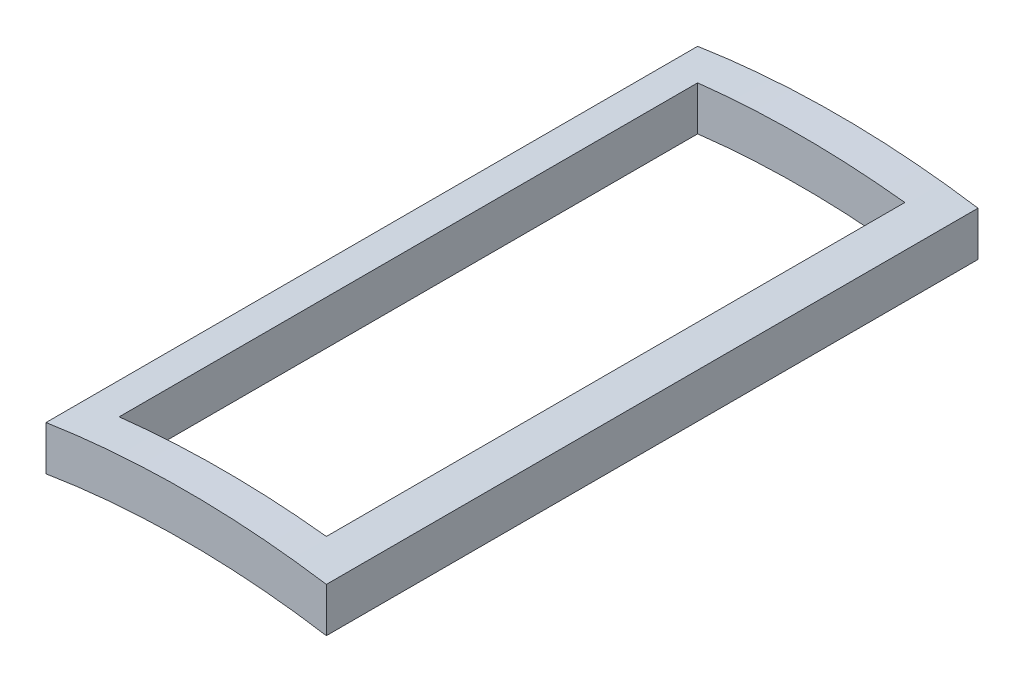
ISO-10303-21;
HEADER;
FILE_DESCRIPTION(('STEP AP214'),'2;1');
FILE_NAME('part.step','',(''),(''),'','','');
FILE_SCHEMA(('AUTOMOTIVE_DESIGN { 1 0 10303 214 1 1 1 1 }'));
ENDSEC;
DATA;
#1=APPLICATION_CONTEXT('core data for automotive mechanical design processes');
#2=APPLICATION_PROTOCOL_DEFINITION('international standard','automotive_design',2000,#1);
#3=PRODUCT_CONTEXT('',#1,'mechanical');
#4=PRODUCT('Part','Part','',(#3));
#5=PRODUCT_RELATED_PRODUCT_CATEGORY('part','',(#4));
#6=PRODUCT_DEFINITION_FORMATION('','',#4);
#7=PRODUCT_DEFINITION_CONTEXT('part definition',#1,'design');
#8=PRODUCT_DEFINITION('design','',#6,#7);
#9=PRODUCT_DEFINITION_SHAPE('','',#8);
#10=(LENGTH_UNIT() NAMED_UNIT(*) SI_UNIT(.MILLI.,.METRE.));
#11=(NAMED_UNIT(*) PLANE_ANGLE_UNIT() SI_UNIT($,.RADIAN.));
#12=(NAMED_UNIT(*) SI_UNIT($,.STERADIAN.) SOLID_ANGLE_UNIT());
#13=UNCERTAINTY_MEASURE_WITH_UNIT(LENGTH_MEASURE(1.E-05),#10,'distance_accuracy_value','');
#14=(GEOMETRIC_REPRESENTATION_CONTEXT(3) GLOBAL_UNCERTAINTY_ASSIGNED_CONTEXT((#13)) GLOBAL_UNIT_ASSIGNED_CONTEXT((#10,
#11,#12)) REPRESENTATION_CONTEXT('',''));
#15=CARTESIAN_POINT('',(0.,0.,0.));
#16=DIRECTION('',(0.,0.,1.));
#17=DIRECTION('',(1.,0.,0.));
#18=AXIS2_PLACEMENT_3D('',#15,#16,#17);
#19=CARTESIAN_POINT('',(-110.435261655171,-75.8999546142996,6.56206354763537));
#20=DIRECTION('',(0.,0.,1.));
#21=DIRECTION('',(0.,-1.,0.));
#22=AXIS2_PLACEMENT_3D('',#19,#20,#21);
#23=CYLINDRICAL_SURFACE('',#22,2.50000000000002);
#24=DIRECTION('',(0.,0.,1.));
#25=VECTOR('',#24,1.);
#26=CARTESIAN_POINT('',(-110.152003047214,-73.4160535371594,9.26746205984028));
#27=LINE('',#26,#25);
#28=CARTESIAN_POINT('',(-110.152003047214,-73.4160535371594,9.26746205984028));
#29=VERTEX_POINT('',#28);
#30=CARTESIAN_POINT('',(-110.152003047214,-73.4160535371594,7.6859348320808));
#31=VERTEX_POINT('',#30);
#32=EDGE_CURVE('E83',#29,#31,#27,.F.);
#33=ORIENTED_EDGE('',*,*,#32,.F.);
#34=CARTESIAN_POINT('',(-110.435261655171,-75.8999546142996,9.26746205984028));
#35=DIRECTION('',(0.,0.,1.));
#36=DIRECTION('',(0.,-1.,0.));
#37=AXIS2_PLACEMENT_3D('',#34,#35,#36);
#38=CIRCLE('',#37,2.50000000000002);
#39=CARTESIAN_POINT('',(-110.718520263128,-73.4160535371594,9.26746205984028));
#40=VERTEX_POINT('',#39);
#41=EDGE_CURVE('E93',#40,#29,#38,.F.);
#42=ORIENTED_EDGE('',*,*,#41,.F.);
#43=DIRECTION('',(0.,0.,-1.));
#44=VECTOR('',#43,1.);
#45=CARTESIAN_POINT('',(-110.718520263128,-73.4160535371594,7.6859348320808));
#46=LINE('',#45,#44);
#47=CARTESIAN_POINT('',(-110.718520263128,-73.4160535371594,7.6859348320808));
#48=VERTEX_POINT('',#47);
#49=EDGE_CURVE('E85',#48,#40,#46,.F.);
#50=ORIENTED_EDGE('',*,*,#49,.F.);
#51=CARTESIAN_POINT('',(-110.435261655171,-75.8999546142996,7.6859348320808));
#52=DIRECTION('',(0.,0.,1.));
#53=DIRECTION('',(0.,-1.,0.));
#54=AXIS2_PLACEMENT_3D('',#51,#52,#53);
#55=CIRCLE('',#54,2.50000000000002);
#56=EDGE_CURVE('E20',#48,#31,#55,.F.);
#57=ORIENTED_EDGE('',*,*,#56,.T.);
#58=EDGE_LOOP('',(#33,#42,#50,#57));
#59=FACE_BOUND('',#58,.T.);
#60=CARTESIAN_POINT('',(-110.435261655171,-75.8999546142996,9.36746205984028));
#61=DIRECTION('',(0.,0.,1.));
#62=DIRECTION('',(0.,-1.,0.));
#63=AXIS2_PLACEMENT_3D('',#60,#61,#62);
#64=CIRCLE('',#63,2.50000000000002);
#65=CARTESIAN_POINT('',(-110.052003047214,-73.4295067117064,9.36746205984028));
#66=VERTEX_POINT('',#65);
#67=CARTESIAN_POINT('',(-110.818520263128,-73.4295067117065,9.36746205984028));
#68=VERTEX_POINT('',#67);
#69=EDGE_CURVE('E86',#66,#68,#64,.T.);
#70=ORIENTED_EDGE('',*,*,#69,.F.);
#71=DIRECTION('',(0.,0.,-1.));
#72=VECTOR('',#71,1.);
#73=CARTESIAN_POINT('',(-110.052003047214,-73.4295067117064,7.5859348320808));
#74=LINE('',#73,#72);
#75=CARTESIAN_POINT('',(-110.052003047214,-73.4295067117064,7.5859348320808));
#76=VERTEX_POINT('',#75);
#77=EDGE_CURVE('E124',#76,#66,#74,.F.);
#78=ORIENTED_EDGE('',*,*,#77,.F.);
#79=CARTESIAN_POINT('',(-110.435261655171,-75.8999546142996,7.5859348320808));
#80=DIRECTION('',(0.,0.,1.));
#81=DIRECTION('',(0.,-1.,0.));
#82=AXIS2_PLACEMENT_3D('',#79,#80,#81);
#83=CIRCLE('',#82,2.50000000000002);
#84=CARTESIAN_POINT('',(-110.818520263128,-73.4295067117065,7.5859348320808));
#85=VERTEX_POINT('',#84);
#86=EDGE_CURVE('E113',#85,#76,#83,.F.);
#87=ORIENTED_EDGE('',*,*,#86,.F.);
#88=DIRECTION('',(0.,0.,1.));
#89=VECTOR('',#88,1.);
#90=CARTESIAN_POINT('',(-110.818520263128,-73.4295067117065,9.36746205984028));
#91=LINE('',#90,#89);
#92=EDGE_CURVE('E121',#68,#85,#91,.F.);
#93=ORIENTED_EDGE('',*,*,#92,.F.);
#94=EDGE_LOOP('',(#70,#78,#87,#93));
#95=FACE_BOUND('',#94,.T.);
#96=ADVANCED_FACE('F17',(#59,#95),#23,.T.);
#97=CARTESIAN_POINT('',(-110.052003047214,-76.3010935552146,9.36746205984028));
#98=DIRECTION('',(0.,0.,1.));
#99=DIRECTION('',(0.,-1.,0.));
#100=AXIS2_PLACEMENT_3D('',#97,#98,#99);
#101=PLANE('',#100);
#102=ORIENTED_EDGE('',*,*,#69,.T.);
#103=DIRECTION('',(0.,1.,0.));
#104=VECTOR('',#103,1.);
#105=CARTESIAN_POINT('',(-110.818520263128,-76.3010935552146,9.36746205984028));
#106=LINE('',#105,#104);
#107=CARTESIAN_POINT('',(-110.818520263128,-73.5510159519615,9.36746205984028));
#108=VERTEX_POINT('',#107);
#109=EDGE_CURVE('E112',#108,#68,#106,.T.);
#110=ORIENTED_EDGE('',*,*,#109,.F.);
#111=CARTESIAN_POINT('',(-110.435261655171,-75.8999546142996,9.36746205984028));
#112=DIRECTION('',(0.,0.,1.));
#113=DIRECTION('',(0.,-1.,0.));
#114=AXIS2_PLACEMENT_3D('',#111,#112,#113);
#115=CIRCLE('',#114,2.38000000000001);
#116=CARTESIAN_POINT('',(-110.052003047214,-73.5510159519615,9.36746205984028));
#117=VERTEX_POINT('',#116);
#118=EDGE_CURVE('E99',#108,#117,#115,.F.);
#119=ORIENTED_EDGE('',*,*,#118,.T.);
#120=DIRECTION('',(0.,1.,0.));
#121=VECTOR('',#120,1.);
#122=CARTESIAN_POINT('',(-110.052003047214,-76.3010935552146,9.36746205984028));
#123=LINE('',#122,#121);
#124=EDGE_CURVE('E122',#66,#117,#123,.F.);
#125=ORIENTED_EDGE('',*,*,#124,.F.);
#126=EDGE_LOOP('',(#102,#110,#119,#125));
#127=FACE_BOUND('',#126,.T.);
#128=ADVANCED_FACE('F141',(#127),#101,.T.);
#129=CARTESIAN_POINT('',(-110.052003047214,-76.3010935552146,7.5859348320808));
#130=DIRECTION('',(1.,0.,0.));
#131=DIRECTION('',(0.,0.,-1.));
#132=AXIS2_PLACEMENT_3D('',#129,#130,#131);
#133=PLANE('',#132);
#134=ORIENTED_EDGE('',*,*,#77,.T.);
#135=ORIENTED_EDGE('',*,*,#124,.T.);
#136=DIRECTION('',(0.,0.,1.));
#137=VECTOR('',#136,1.);
#138=CARTESIAN_POINT('',(-110.052003047214,-73.5510159519615,6.56206354763537));
#139=LINE('',#138,#137);
#140=CARTESIAN_POINT('',(-110.052003047214,-73.5510159519615,7.5859348320808));
#141=VERTEX_POINT('',#140);
#142=EDGE_CURVE('E114',#117,#141,#139,.F.);
#143=ORIENTED_EDGE('',*,*,#142,.T.);
#144=DIRECTION('',(0.,1.,0.));
#145=VECTOR('',#144,1.);
#146=CARTESIAN_POINT('',(-110.052003047214,-76.3010935552146,7.5859348320808));
#147=LINE('',#146,#145);
#148=EDGE_CURVE('E110',#76,#141,#147,.F.);
#149=ORIENTED_EDGE('',*,*,#148,.F.);
#150=EDGE_LOOP('',(#134,#135,#143,#149));
#151=FACE_BOUND('',#150,.T.);
#152=ADVANCED_FACE('F157',(#151),#133,.T.);
#153=CARTESIAN_POINT('',(-110.818520263128,-76.3010935552146,7.5859348320808));
#154=DIRECTION('',(0.,0.,-1.));
#155=DIRECTION('',(0.,1.,0.));
#156=AXIS2_PLACEMENT_3D('',#153,#154,#155);
#157=PLANE('',#156);
#158=ORIENTED_EDGE('',*,*,#86,.T.);
#159=ORIENTED_EDGE('',*,*,#148,.T.);
#160=CARTESIAN_POINT('',(-110.435261655171,-75.8999546142996,7.5859348320808));
#161=DIRECTION('',(0.,0.,1.));
#162=DIRECTION('',(0.,-1.,0.));
#163=AXIS2_PLACEMENT_3D('',#160,#161,#162);
#164=CIRCLE('',#163,2.38000000000001);
#165=CARTESIAN_POINT('',(-110.818520263128,-73.5510159519615,7.5859348320808));
#166=VERTEX_POINT('',#165);
#167=EDGE_CURVE('E117',#141,#166,#164,.T.);
#168=ORIENTED_EDGE('',*,*,#167,.T.);
#169=DIRECTION('',(0.,1.,0.));
#170=VECTOR('',#169,1.);
#171=CARTESIAN_POINT('',(-110.818520263128,-76.3010935552146,7.5859348320808));
#172=LINE('',#171,#170);
#173=EDGE_CURVE('E94',#85,#166,#172,.F.);
#174=ORIENTED_EDGE('',*,*,#173,.F.);
#175=EDGE_LOOP('',(#158,#159,#168,#174));
#176=FACE_BOUND('',#175,.T.);
#177=ADVANCED_FACE('F151',(#176),#157,.T.);
#178=CARTESIAN_POINT('',(-110.818520263128,-76.3010935552146,9.36746205984028));
#179=DIRECTION('',(-1.,0.,0.));
#180=DIRECTION('',(0.,0.,1.));
#181=AXIS2_PLACEMENT_3D('',#178,#179,#180);
#182=PLANE('',#181);
#183=ORIENTED_EDGE('',*,*,#92,.T.);
#184=ORIENTED_EDGE('',*,*,#173,.T.);
#185=DIRECTION('',(0.,0.,1.));
#186=VECTOR('',#185,1.);
#187=CARTESIAN_POINT('',(-110.818520263128,-73.5510159519615,6.56206354763537));
#188=LINE('',#187,#186);
#189=EDGE_CURVE('E107',#166,#108,#188,.T.);
#190=ORIENTED_EDGE('',*,*,#189,.T.);
#191=ORIENTED_EDGE('',*,*,#109,.T.);
#192=EDGE_LOOP('',(#183,#184,#190,#191));
#193=FACE_BOUND('',#192,.T.);
#194=ADVANCED_FACE('F145',(#193),#182,.T.);
#195=CARTESIAN_POINT('',(-110.152003047214,-76.3010935552146,9.26746205984028));
#196=DIRECTION('',(-1.,0.,0.));
#197=DIRECTION('',(0.,0.,1.));
#198=AXIS2_PLACEMENT_3D('',#195,#196,#197);
#199=PLANE('',#198);
#200=ORIENTED_EDGE('',*,*,#32,.T.);
#201=DIRECTION('',(0.,-1.,0.));
#202=VECTOR('',#201,1.);
#203=CARTESIAN_POINT('',(-110.152003047214,-76.3010935552146,7.6859348320808));
#204=LINE('',#203,#202);
#205=CARTESIAN_POINT('',(-110.152003047214,-73.5368709168783,7.6859348320808));
#206=VERTEX_POINT('',#205);
#207=EDGE_CURVE('E91',#206,#31,#204,.F.);
#208=ORIENTED_EDGE('',*,*,#207,.F.);
#209=DIRECTION('',(0.,0.,1.));
#210=VECTOR('',#209,1.);
#211=CARTESIAN_POINT('',(-110.152003047214,-73.5368709168783,6.56206354763537));
#212=LINE('',#211,#210);
#213=CARTESIAN_POINT('',(-110.152003047214,-73.5368709168783,9.26746205984028));
#214=VERTEX_POINT('',#213);
#215=EDGE_CURVE('E106',#206,#214,#212,.T.);
#216=ORIENTED_EDGE('',*,*,#215,.T.);
#217=DIRECTION('',(0.,1.,0.));
#218=VECTOR('',#217,1.);
#219=CARTESIAN_POINT('',(-110.152003047214,-76.3010935552146,9.26746205984028));
#220=LINE('',#219,#218);
#221=EDGE_CURVE('E92',#29,#214,#220,.F.);
#222=ORIENTED_EDGE('',*,*,#221,.F.);
#223=EDGE_LOOP('',(#200,#208,#216,#222));
#224=FACE_BOUND('',#223,.T.);
#225=ADVANCED_FACE('F89',(#224),#199,.T.);
#226=CARTESIAN_POINT('',(-110.718520263128,-76.3010935552146,9.26746205984028));
#227=DIRECTION('',(0.,0.,-1.));
#228=DIRECTION('',(0.,1.,0.));
#229=AXIS2_PLACEMENT_3D('',#226,#227,#228);
#230=PLANE('',#229);
#231=ORIENTED_EDGE('',*,*,#41,.T.);
#232=ORIENTED_EDGE('',*,*,#221,.T.);
#233=CARTESIAN_POINT('',(-110.435261655171,-75.8999546142996,9.26746205984028));
#234=DIRECTION('',(0.,0.,1.));
#235=DIRECTION('',(0.,-1.,0.));
#236=AXIS2_PLACEMENT_3D('',#233,#234,#235);
#237=CIRCLE('',#236,2.38000000000001);
#238=CARTESIAN_POINT('',(-110.718520263128,-73.5368709168783,9.26746205984028));
#239=VERTEX_POINT('',#238);
#240=EDGE_CURVE('E105',#214,#239,#237,.T.);
#241=ORIENTED_EDGE('',*,*,#240,.T.);
#242=DIRECTION('',(0.,1.,0.));
#243=VECTOR('',#242,1.);
#244=CARTESIAN_POINT('',(-110.718520263128,-76.3010935552146,9.26746205984028));
#245=LINE('',#244,#243);
#246=EDGE_CURVE('E97',#40,#239,#245,.F.);
#247=ORIENTED_EDGE('',*,*,#246,.F.);
#248=EDGE_LOOP('',(#231,#232,#241,#247));
#249=FACE_BOUND('',#248,.T.);
#250=ADVANCED_FACE('F178',(#249),#230,.T.);
#251=CARTESIAN_POINT('',(-110.718520263128,-76.3010935552146,7.6859348320808));
#252=DIRECTION('',(1.,0.,0.));
#253=DIRECTION('',(0.,0.,-1.));
#254=AXIS2_PLACEMENT_3D('',#251,#252,#253);
#255=PLANE('',#254);
#256=ORIENTED_EDGE('',*,*,#49,.T.);
#257=ORIENTED_EDGE('',*,*,#246,.T.);
#258=DIRECTION('',(0.,0.,1.));
#259=VECTOR('',#258,1.);
#260=CARTESIAN_POINT('',(-110.718520263128,-73.5368709168783,6.56206354763537));
#261=LINE('',#260,#259);
#262=CARTESIAN_POINT('',(-110.718520263128,-73.5368709168783,7.6859348320808));
#263=VERTEX_POINT('',#262);
#264=EDGE_CURVE('E26',#239,#263,#261,.F.);
#265=ORIENTED_EDGE('',*,*,#264,.T.);
#266=DIRECTION('',(0.,-1.,0.));
#267=VECTOR('',#266,1.);
#268=CARTESIAN_POINT('',(-110.718520263128,-76.3010935552146,7.6859348320808));
#269=LINE('',#268,#267);
#270=EDGE_CURVE('E34',#48,#263,#269,.T.);
#271=ORIENTED_EDGE('',*,*,#270,.F.);
#272=EDGE_LOOP('',(#256,#257,#265,#271));
#273=FACE_BOUND('',#272,.T.);
#274=ADVANCED_FACE('F172',(#273),#255,.T.);
#275=CARTESIAN_POINT('',(-110.152003047214,-76.3010935552146,7.6859348320808));
#276=DIRECTION('',(0.,0.,1.));
#277=DIRECTION('',(0.,-1.,0.));
#278=AXIS2_PLACEMENT_3D('',#275,#276,#277);
#279=PLANE('',#278);
#280=ORIENTED_EDGE('',*,*,#56,.F.);
#281=ORIENTED_EDGE('',*,*,#270,.T.);
#282=CARTESIAN_POINT('',(-110.435261655171,-75.8999546142996,7.6859348320808));
#283=DIRECTION('',(0.,0.,1.));
#284=DIRECTION('',(0.,-1.,0.));
#285=AXIS2_PLACEMENT_3D('',#282,#283,#284);
#286=CIRCLE('',#285,2.38000000000001);
#287=EDGE_CURVE('E11',#263,#206,#286,.F.);
#288=ORIENTED_EDGE('',*,*,#287,.T.);
#289=ORIENTED_EDGE('',*,*,#207,.T.);
#290=EDGE_LOOP('',(#280,#281,#288,#289));
#291=FACE_BOUND('',#290,.T.);
#292=ADVANCED_FACE('F96',(#291),#279,.T.);
#293=CARTESIAN_POINT('',(-110.435261655171,-75.8999546142996,6.56206354763537));
#294=DIRECTION('',(0.,0.,1.));
#295=DIRECTION('',(0.,-1.,0.));
#296=AXIS2_PLACEMENT_3D('',#293,#294,#295);
#297=CYLINDRICAL_SURFACE('',#296,2.38000000000001);
#298=ORIENTED_EDGE('',*,*,#264,.F.);
#299=ORIENTED_EDGE('',*,*,#240,.F.);
#300=ORIENTED_EDGE('',*,*,#215,.F.);
#301=ORIENTED_EDGE('',*,*,#287,.F.);
#302=EDGE_LOOP('',(#298,#299,#300,#301));
#303=FACE_BOUND('',#302,.T.);
#304=ORIENTED_EDGE('',*,*,#167,.F.);
#305=ORIENTED_EDGE('',*,*,#142,.F.);
#306=ORIENTED_EDGE('',*,*,#118,.F.);
#307=ORIENTED_EDGE('',*,*,#189,.F.);
#308=EDGE_LOOP('',(#304,#305,#306,#307));
#309=FACE_BOUND('',#308,.T.);
#310=ADVANCED_FACE('F154',(#303,#309),#297,.F.);
#311=CLOSED_SHELL('',(#96,#128,#152,#177,#194,#225,#250,#274,#292,#310));
#312=MANIFOLD_SOLID_BREP('B1',#311);
#313=ADVANCED_BREP_SHAPE_REPRESENTATION('',(#18,#312),#14);
#314=SHAPE_DEFINITION_REPRESENTATION(#9,#313);
ENDSEC;
END-ISO-10303-21;
